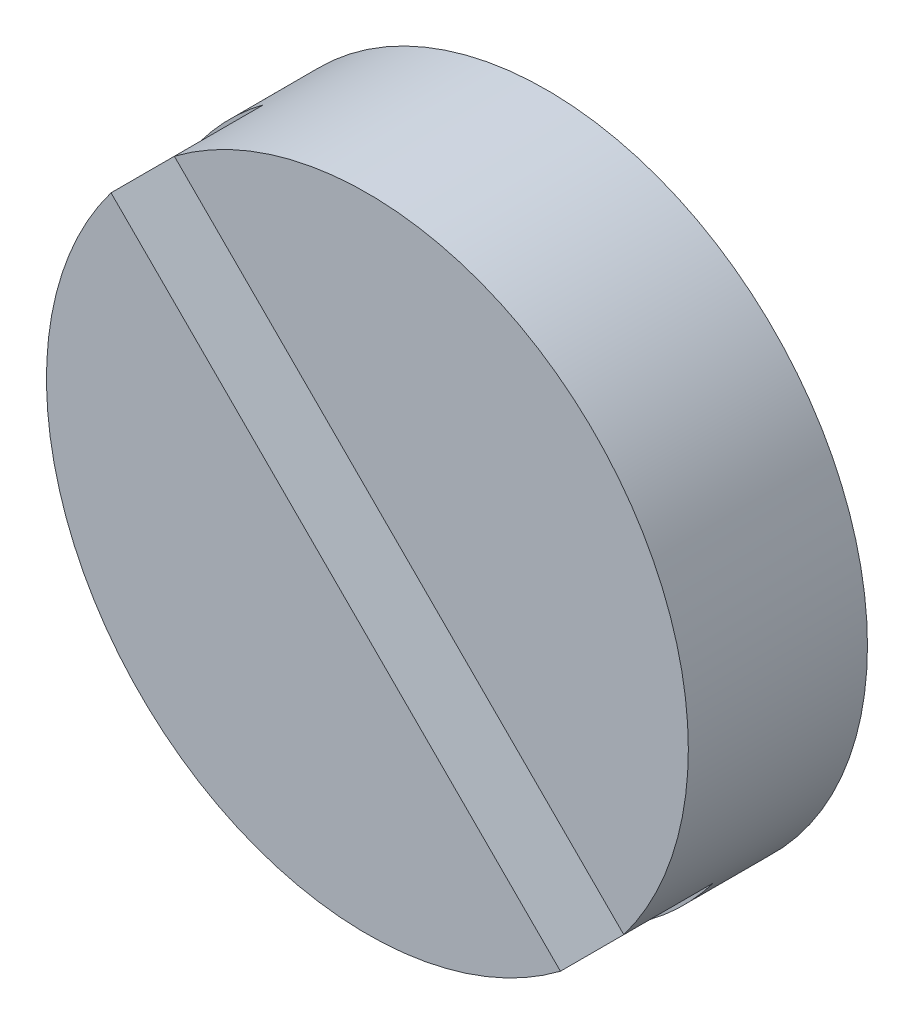
ISO-10303-21;
HEADER;
FILE_DESCRIPTION(('STEP AP214'),'2;1');
FILE_NAME('part.step','',(''),(''),'','','');
FILE_SCHEMA(('AUTOMOTIVE_DESIGN { 1 0 10303 214 1 1 1 1 }'));
ENDSEC;
DATA;
#1=APPLICATION_CONTEXT('core data for automotive mechanical design processes');
#2=APPLICATION_PROTOCOL_DEFINITION('international standard','automotive_design',2000,#1);
#3=PRODUCT_CONTEXT('',#1,'mechanical');
#4=PRODUCT('Part','Part','',(#3));
#5=PRODUCT_RELATED_PRODUCT_CATEGORY('part','',(#4));
#6=PRODUCT_DEFINITION_FORMATION('','',#4);
#7=PRODUCT_DEFINITION_CONTEXT('part definition',#1,'design');
#8=PRODUCT_DEFINITION('design','',#6,#7);
#9=PRODUCT_DEFINITION_SHAPE('','',#8);
#10=(LENGTH_UNIT() NAMED_UNIT(*) SI_UNIT(.MILLI.,.METRE.));
#11=(NAMED_UNIT(*) PLANE_ANGLE_UNIT() SI_UNIT($,.RADIAN.));
#12=(NAMED_UNIT(*) SI_UNIT($,.STERADIAN.) SOLID_ANGLE_UNIT());
#13=UNCERTAINTY_MEASURE_WITH_UNIT(LENGTH_MEASURE(1.E-05),#10,'distance_accuracy_value','');
#14=(GEOMETRIC_REPRESENTATION_CONTEXT(3) GLOBAL_UNCERTAINTY_ASSIGNED_CONTEXT((#13)) GLOBAL_UNIT_ASSIGNED_CONTEXT((#10,
#11,#12)) REPRESENTATION_CONTEXT('',''));
#15=CARTESIAN_POINT('',(0.,0.,0.));
#16=DIRECTION('',(0.,0.,1.));
#17=DIRECTION('',(1.,0.,0.));
#18=AXIS2_PLACEMENT_3D('',#15,#16,#17);
#19=CARTESIAN_POINT('',(17.3029324650882,12.2064521676477,49.3014));
#20=DIRECTION('',(0.707106781186549,0.707106781186546,0.));
#21=DIRECTION('',(0.,0.,-1.));
#22=AXIS2_PLACEMENT_3D('',#19,#20,#21);
#23=PLANE('',#22);
#24=DIRECTION('',(0.,0.,1.));
#25=VECTOR('',#24,1.);
#26=CARTESIAN_POINT('',(13.0968255257677,16.4125591069682,48.8442));
#27=LINE('',#26,#25);
#28=CARTESIAN_POINT('',(13.0968255257677,16.4125591069681,48.4632));
#29=VERTEX_POINT('',#28);
#30=CARTESIAN_POINT('',(13.0968255257677,16.4125591069682,49.2252));
#31=VERTEX_POINT('',#30);
#32=EDGE_CURVE('E79',#29,#31,#27,.T.);
#33=ORIENTED_EDGE('',*,*,#32,.T.);
#34=DIRECTION('',(-0.707106781186546,0.707106781186549,0.));
#35=VECTOR('',#34,1.);
#36=CARTESIAN_POINT('',(15.0086923163679,14.5006923163679,49.2252));
#37=LINE('',#36,#35);
#38=CARTESIAN_POINT('',(16.9205591069681,12.5888255257677,49.2252));
#39=VERTEX_POINT('',#38);
#40=EDGE_CURVE('E81',#39,#31,#37,.T.);
#41=ORIENTED_EDGE('',*,*,#40,.F.);
#42=DIRECTION('',(0.,0.,-1.));
#43=VECTOR('',#42,1.);
#44=CARTESIAN_POINT('',(16.9205591069681,12.5888255257677,48.8442));
#45=LINE('',#44,#43);
#46=CARTESIAN_POINT('',(16.9205591069681,12.5888255257677,48.4632));
#47=VERTEX_POINT('',#46);
#48=EDGE_CURVE('E82',#39,#47,#45,.T.);
#49=ORIENTED_EDGE('',*,*,#48,.T.);
#50=DIRECTION('',(0.707106781186546,-0.707106781186549,0.));
#51=VECTOR('',#50,1.);
#52=CARTESIAN_POINT('',(15.0086923163679,14.5006923163679,48.4632));
#53=LINE('',#52,#51);
#54=EDGE_CURVE('E66',#29,#47,#53,.T.);
#55=ORIENTED_EDGE('',*,*,#54,.F.);
#56=EDGE_LOOP('',(#33,#41,#49,#55));
#57=FACE_BOUND('',#56,.T.);
#58=ADVANCED_FACE('F17',(#57),#23,.T.);
#59=CARTESIAN_POINT('',(9.48893551574705,14.2267874624914,49.2252));
#60=DIRECTION('',(0.,0.,1.));
#61=DIRECTION('',(0.707106781186546,-0.707106781186549,0.));
#62=AXIS2_PLACEMENT_3D('',#59,#60,#61);
#63=PLANE('',#62);
#64=ORIENTED_EDGE('',*,*,#40,.T.);
#65=CARTESIAN_POINT('',(15.2781,14.7701,49.2252));
#66=DIRECTION('',(0.,0.,1.));
#67=DIRECTION('',(1.,0.,0.));
#68=AXIS2_PLACEMENT_3D('',#65,#66,#67);
#69=CIRCLE('',#68,2.73049999999999);
#70=EDGE_CURVE('E67',#39,#31,#69,.F.);
#71=ORIENTED_EDGE('',*,*,#70,.F.);
#72=EDGE_LOOP('',(#64,#71));
#73=FACE_BOUND('',#72,.T.);
#74=ADVANCED_FACE('F91',(#73),#63,.T.);
#75=CARTESIAN_POINT('',(20.5131587381575,14.7701,48.4632));
#76=DIRECTION('',(0.,0.,1.));
#77=DIRECTION('',(-0.707106781186546,0.707106781186549,0.));
#78=AXIS2_PLACEMENT_3D('',#75,#76,#77);
#79=PLANE('',#78);
#80=ORIENTED_EDGE('',*,*,#54,.T.);
#81=CARTESIAN_POINT('',(15.2781,14.7701,48.4632));
#82=DIRECTION('',(0.,0.,1.));
#83=DIRECTION('',(1.,0.,0.));
#84=AXIS2_PLACEMENT_3D('',#81,#82,#83);
#85=CIRCLE('',#84,2.73049999999999);
#86=CARTESIAN_POINT('',(17.4593744742323,13.1276408930319,48.4632));
#87=VERTEX_POINT('',#86);
#88=EDGE_CURVE('E21',#87,#47,#85,.F.);
#89=ORIENTED_EDGE('',*,*,#88,.F.);
#90=DIRECTION('',(0.707106781186547,-0.707106781186547,0.));
#91=VECTOR('',#90,1.);
#92=CARTESIAN_POINT('',(15.5475076836321,15.0395076836321,48.4632));
#93=LINE('',#92,#91);
#94=CARTESIAN_POINT('',(13.6356408930319,16.9513744742323,48.4632));
#95=VERTEX_POINT('',#94);
#96=EDGE_CURVE('E63',#95,#87,#93,.T.);
#97=ORIENTED_EDGE('',*,*,#96,.F.);
#98=CARTESIAN_POINT('',(15.2781,14.7701,48.4632));
#99=DIRECTION('',(0.,0.,1.));
#100=DIRECTION('',(1.,0.,0.));
#101=AXIS2_PLACEMENT_3D('',#98,#99,#100);
#102=CIRCLE('',#101,2.73049999999999);
#103=EDGE_CURVE('E56',#29,#95,#102,.F.);
#104=ORIENTED_EDGE('',*,*,#103,.F.);
#105=EDGE_LOOP('',(#80,#89,#97,#104));
#106=FACE_BOUND('',#105,.T.);
#107=ADVANCED_FACE('F62',(#106),#79,.T.);
#108=CARTESIAN_POINT('',(17.8417478323523,12.7452675349118,48.387));
#109=DIRECTION('',(-0.707106781186548,-0.707106781186547,0.));
#110=DIRECTION('',(0.,0.,1.));
#111=AXIS2_PLACEMENT_3D('',#108,#109,#110);
#112=PLANE('',#111);
#113=DIRECTION('',(0.,0.,-1.));
#114=VECTOR('',#113,1.);
#115=CARTESIAN_POINT('',(13.6356408930319,16.9513744742323,48.8442));
#116=LINE('',#115,#114);
#117=CARTESIAN_POINT('',(13.6356408930319,16.9513744742323,49.2252));
#118=VERTEX_POINT('',#117);
#119=EDGE_CURVE('E71',#118,#95,#116,.T.);
#120=ORIENTED_EDGE('',*,*,#119,.T.);
#121=ORIENTED_EDGE('',*,*,#96,.T.);
#122=DIRECTION('',(0.,0.,1.));
#123=VECTOR('',#122,1.);
#124=CARTESIAN_POINT('',(17.4593744742323,13.1276408930319,48.8442));
#125=LINE('',#124,#123);
#126=CARTESIAN_POINT('',(17.4593744742323,13.1276408930319,49.2252));
#127=VERTEX_POINT('',#126);
#128=EDGE_CURVE('E36',#87,#127,#125,.T.);
#129=ORIENTED_EDGE('',*,*,#128,.T.);
#130=DIRECTION('',(0.707106781186546,-0.707106781186549,0.));
#131=VECTOR('',#130,1.);
#132=CARTESIAN_POINT('',(15.5475076836321,15.0395076836321,49.2252));
#133=LINE('',#132,#131);
#134=EDGE_CURVE('E74',#118,#127,#133,.T.);
#135=ORIENTED_EDGE('',*,*,#134,.F.);
#136=EDGE_LOOP('',(#120,#121,#129,#135));
#137=FACE_BOUND('',#136,.T.);
#138=ADVANCED_FACE('F73',(#137),#112,.T.);
#139=CARTESIAN_POINT('',(15.2781,8.25810514612762,47.7012));
#140=DIRECTION('',(0.,0.,-1.));
#141=DIRECTION('',(-0.707106781186546,0.707106781186549,0.));
#142=AXIS2_PLACEMENT_3D('',#139,#140,#141);
#143=PLANE('',#142);
#144=CARTESIAN_POINT('',(15.2781,14.7701,47.7012));
#145=DIRECTION('',(0.,0.,1.));
#146=DIRECTION('',(1.,0.,0.));
#147=AXIS2_PLACEMENT_3D('',#144,#145,#146);
#148=CIRCLE('',#147,2.73049999999999);
#149=CARTESIAN_POINT('',(18.0086,14.7701,47.7012));
#150=VERTEX_POINT('',#149);
#151=EDGE_CURVE('E27',#150,#150,#148,.T.);
#152=ORIENTED_EDGE('',*,*,#151,.F.);
#153=EDGE_LOOP('',(#152));
#154=FACE_BOUND('',#153,.T.);
#155=ADVANCED_FACE('F107',(#154),#143,.T.);
#156=CARTESIAN_POINT('',(10.5755605907643,15.3134125375087,49.2252));
#157=DIRECTION('',(0.,0.,1.));
#158=DIRECTION('',(0.707106781186544,-0.707106781186551,0.));
#159=AXIS2_PLACEMENT_3D('',#156,#157,#158);
#160=PLANE('',#159);
#161=ORIENTED_EDGE('',*,*,#134,.T.);
#162=CARTESIAN_POINT('',(15.2781,14.7701,49.2252));
#163=DIRECTION('',(0.,0.,1.));
#164=DIRECTION('',(1.,0.,0.));
#165=AXIS2_PLACEMENT_3D('',#162,#163,#164);
#166=CIRCLE('',#165,2.73049999999999);
#167=EDGE_CURVE('E11',#118,#127,#166,.F.);
#168=ORIENTED_EDGE('',*,*,#167,.F.);
#169=EDGE_LOOP('',(#161,#168));
#170=FACE_BOUND('',#169,.T.);
#171=ADVANCED_FACE('F19',(#170),#160,.T.);
#172=CARTESIAN_POINT('',(15.2781,14.7701,49.2252));
#173=DIRECTION('',(0.,0.,1.));
#174=DIRECTION('',(1.,0.,0.));
#175=AXIS2_PLACEMENT_3D('',#172,#173,#174);
#176=CYLINDRICAL_SURFACE('',#175,2.73049999999999);
#177=ORIENTED_EDGE('',*,*,#128,.F.);
#178=ORIENTED_EDGE('',*,*,#88,.T.);
#179=ORIENTED_EDGE('',*,*,#48,.F.);
#180=ORIENTED_EDGE('',*,*,#70,.T.);
#181=ORIENTED_EDGE('',*,*,#32,.F.);
#182=ORIENTED_EDGE('',*,*,#103,.T.);
#183=ORIENTED_EDGE('',*,*,#119,.F.);
#184=ORIENTED_EDGE('',*,*,#167,.T.);
#185=EDGE_LOOP('',(#177,#178,#179,#180,#181,#182,#183,#184));
#186=FACE_BOUND('',#185,.T.);
#187=ORIENTED_EDGE('',*,*,#151,.T.);
#188=EDGE_LOOP('',(#187));
#189=FACE_BOUND('',#188,.T.);
#190=ADVANCED_FACE('F68',(#186,#189),#176,.T.);
#191=CLOSED_SHELL('',(#58,#74,#107,#138,#155,#171,#190));
#192=MANIFOLD_SOLID_BREP('B1',#191);
#193=ADVANCED_BREP_SHAPE_REPRESENTATION('',(#18,#192),#14);
#194=SHAPE_DEFINITION_REPRESENTATION(#9,#193);
ENDSEC;
END-ISO-10303-21;
